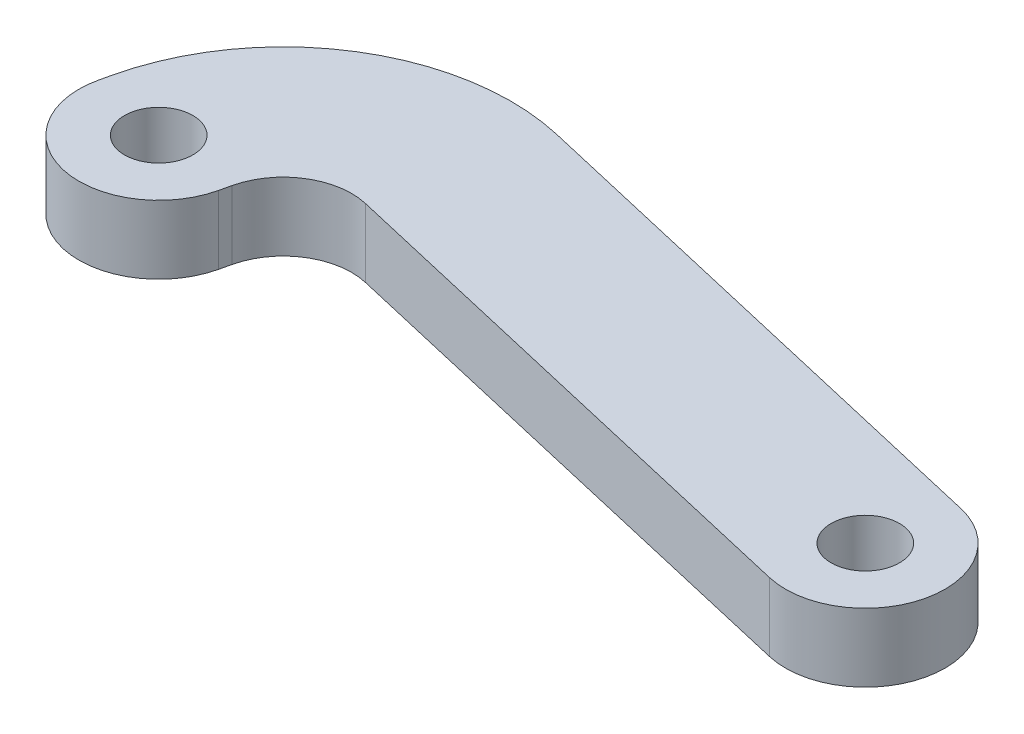
ISO-10303-21;
HEADER;
FILE_DESCRIPTION(('STEP AP214'),'2;1');
FILE_NAME('part.step','',(''),(''),'','','');
FILE_SCHEMA(('AUTOMOTIVE_DESIGN { 1 0 10303 214 1 1 1 1 }'));
ENDSEC;
DATA;
#1=APPLICATION_CONTEXT('core data for automotive mechanical design processes');
#2=APPLICATION_PROTOCOL_DEFINITION('international standard','automotive_design',2000,#1);
#3=PRODUCT_CONTEXT('',#1,'mechanical');
#4=PRODUCT('Part','Part','',(#3));
#5=PRODUCT_RELATED_PRODUCT_CATEGORY('part','',(#4));
#6=PRODUCT_DEFINITION_FORMATION('','',#4);
#7=PRODUCT_DEFINITION_CONTEXT('part definition',#1,'design');
#8=PRODUCT_DEFINITION('design','',#6,#7);
#9=PRODUCT_DEFINITION_SHAPE('','',#8);
#10=(LENGTH_UNIT() NAMED_UNIT(*) SI_UNIT(.MILLI.,.METRE.));
#11=(NAMED_UNIT(*) PLANE_ANGLE_UNIT() SI_UNIT($,.RADIAN.));
#12=(NAMED_UNIT(*) SI_UNIT($,.STERADIAN.) SOLID_ANGLE_UNIT());
#13=UNCERTAINTY_MEASURE_WITH_UNIT(LENGTH_MEASURE(1.E-05),#10,'distance_accuracy_value','');
#14=(GEOMETRIC_REPRESENTATION_CONTEXT(3) GLOBAL_UNCERTAINTY_ASSIGNED_CONTEXT((#13)) GLOBAL_UNIT_ASSIGNED_CONTEXT((#10,
#11,#12)) REPRESENTATION_CONTEXT('',''));
#15=CARTESIAN_POINT('',(0.,0.,0.));
#16=DIRECTION('',(0.,0.,1.));
#17=DIRECTION('',(1.,0.,0.));
#18=AXIS2_PLACEMENT_3D('',#15,#16,#17);
#19=CARTESIAN_POINT('',(31.,3.,0.));
#20=DIRECTION('',(0.,1.,0.));
#21=DIRECTION('',(0.,0.,1.));
#22=AXIS2_PLACEMENT_3D('',#19,#20,#21);
#23=PLANE('',#22);
#24=CARTESIAN_POINT('',(0.,3.,0.));
#25=DIRECTION('',(0.,1.,0.));
#26=DIRECTION('',(0.,0.,1.));
#27=AXIS2_PLACEMENT_3D('',#24,#25,#26);
#28=CIRCLE('',#27,1.5);
#29=CARTESIAN_POINT('',(0.,3.,1.5));
#30=VERTEX_POINT('',#29);
#31=EDGE_CURVE('E135',#30,#30,#28,.T.);
#32=ORIENTED_EDGE('',*,*,#31,.F.);
#33=EDGE_LOOP('',(#32));
#34=FACE_BOUND('',#33,.T.);
#35=CARTESIAN_POINT('',(31.,3.,0.));
#36=DIRECTION('',(0.,1.,0.));
#37=DIRECTION('',(0.,0.,1.));
#38=AXIS2_PLACEMENT_3D('',#35,#36,#37);
#39=CIRCLE('',#38,3.5);
#40=CARTESIAN_POINT('',(30.2096774193548,3.,3.40960264818679));
#41=VERTEX_POINT('',#40);
#42=CARTESIAN_POINT('',(31.7903225806452,3.,-3.40960264818679));
#43=VERTEX_POINT('',#42);
#44=EDGE_CURVE('E146',#41,#43,#39,.T.);
#45=ORIENTED_EDGE('',*,*,#44,.T.);
#46=DIRECTION('',(-0.974172185196226,0.,-0.225806451612903));
#47=VECTOR('',#46,1.);
#48=CARTESIAN_POINT('',(8.70308694571095,3.,-8.7610660090765));
#49=LINE('',#48,#47);
#50=CARTESIAN_POINT('',(8.70308694571095,3.,-8.7610660090765));
#51=VERTEX_POINT('',#50);
#52=EDGE_CURVE('E94',#43,#51,#49,.T.);
#53=ORIENTED_EDGE('',*,*,#52,.T.);
#54=CARTESIAN_POINT('',(6.44502242958192,3.,0.98065584288576));
#55=DIRECTION('',(0.,1.,0.));
#56=DIRECTION('',(0.,0.,-1.));
#57=AXIS2_PLACEMENT_3D('',#54,#55,#56);
#58=CIRCLE('',#57,10.);
#59=CARTESIAN_POINT('',(-3.29669942238034,3.,-1.27740867324327));
#60=VERTEX_POINT('',#59);
#61=EDGE_CURVE('E161',#51,#60,#58,.T.);
#62=ORIENTED_EDGE('',*,*,#61,.T.);
#63=DIRECTION('',(-0.225806451612904,0.,0.974172185196226));
#64=VECTOR('',#63,1.);
#65=CARTESIAN_POINT('',(-3.40960264818679,3.,-0.790322580645162));
#66=LINE('',#65,#64);
#67=CARTESIAN_POINT('',(-3.40960264818679,3.,-0.790322580645159));
#68=VERTEX_POINT('',#67);
#69=EDGE_CURVE('E174',#60,#68,#66,.T.);
#70=ORIENTED_EDGE('',*,*,#69,.T.);
#71=CARTESIAN_POINT('',(0.,3.,0.));
#72=DIRECTION('',(0.,1.,0.));
#73=DIRECTION('',(0.,0.,-1.));
#74=AXIS2_PLACEMENT_3D('',#71,#72,#73);
#75=CIRCLE('',#74,3.5);
#76=CARTESIAN_POINT('',(3.40960264818678,3.,0.79032258064516));
#77=VERTEX_POINT('',#76);
#78=EDGE_CURVE('E113',#68,#77,#75,.T.);
#79=ORIENTED_EDGE('',*,*,#78,.T.);
#80=DIRECTION('',(0.225806451612901,0.,-0.974172185196226));
#81=VECTOR('',#80,1.);
#82=CARTESIAN_POINT('',(3.40960264818678,3.,0.79032258064516));
#83=LINE('',#82,#81);
#84=CARTESIAN_POINT('',(3.52250587399324,3.,0.303236488047049));
#85=VERTEX_POINT('',#84);
#86=EDGE_CURVE('E107',#77,#85,#83,.T.);
#87=ORIENTED_EDGE('',*,*,#86,.T.);
#88=CARTESIAN_POINT('',(6.44502242958192,3.,0.980655842885758));
#89=DIRECTION('',(0.,-1.,0.));
#90=DIRECTION('',(0.,0.,-1.));
#91=AXIS2_PLACEMENT_3D('',#88,#89,#90);
#92=CIRCLE('',#91,3.);
#93=CARTESIAN_POINT('',(7.12244178442063,3.,-1.94186071270292));
#94=VERTEX_POINT('',#93);
#95=EDGE_CURVE('E111',#85,#94,#92,.T.);
#96=ORIENTED_EDGE('',*,*,#95,.T.);
#97=DIRECTION('',(0.974172185196226,0.,0.225806451612903));
#98=VECTOR('',#97,1.);
#99=CARTESIAN_POINT('',(7.12244178442063,3.,-1.94186071270292));
#100=LINE('',#99,#98);
#101=EDGE_CURVE('E51',#94,#41,#100,.T.);
#102=ORIENTED_EDGE('',*,*,#101,.T.);
#103=EDGE_LOOP('',(#45,#53,#62,#70,#79,#87,#96,#102));
#104=FACE_BOUND('',#103,.T.);
#105=CARTESIAN_POINT('',(31.,3.,0.));
#106=DIRECTION('',(0.,1.,0.));
#107=DIRECTION('',(0.,0.,1.));
#108=AXIS2_PLACEMENT_3D('',#105,#106,#107);
#109=CIRCLE('',#108,1.5);
#110=CARTESIAN_POINT('',(31.,3.,1.5));
#111=VERTEX_POINT('',#110);
#112=EDGE_CURVE('E183',#111,#111,#109,.T.);
#113=ORIENTED_EDGE('',*,*,#112,.F.);
#114=EDGE_LOOP('',(#113));
#115=FACE_BOUND('',#114,.T.);
#116=ADVANCED_FACE('F34',(#34,#104,#115),#23,.T.);
#117=CARTESIAN_POINT('',(31.,0.,0.));
#118=DIRECTION('',(0.,1.,0.));
#119=DIRECTION('',(0.,0.,1.));
#120=AXIS2_PLACEMENT_3D('',#117,#118,#119);
#121=PLANE('',#120);
#122=CARTESIAN_POINT('',(31.,0.,0.));
#123=DIRECTION('',(0.,1.,0.));
#124=DIRECTION('',(0.,0.,1.));
#125=AXIS2_PLACEMENT_3D('',#122,#123,#124);
#126=CIRCLE('',#125,3.5);
#127=CARTESIAN_POINT('',(30.2096774193548,0.,3.40960264818679));
#128=VERTEX_POINT('',#127);
#129=CARTESIAN_POINT('',(31.7903225806452,0.,-3.40960264818679));
#130=VERTEX_POINT('',#129);
#131=EDGE_CURVE('E131',#128,#130,#126,.T.);
#132=ORIENTED_EDGE('',*,*,#131,.F.);
#133=DIRECTION('',(0.974172185196226,0.,0.225806451612903));
#134=VECTOR('',#133,1.);
#135=CARTESIAN_POINT('',(7.12244178442063,0.,-1.94186071270292));
#136=LINE('',#135,#134);
#137=CARTESIAN_POINT('',(7.12244178442063,0.,-1.94186071270292));
#138=VERTEX_POINT('',#137);
#139=EDGE_CURVE('E86',#138,#128,#136,.T.);
#140=ORIENTED_EDGE('',*,*,#139,.F.);
#141=CARTESIAN_POINT('',(6.44502242958192,0.,0.980655842885758));
#142=DIRECTION('',(0.,-1.,0.));
#143=DIRECTION('',(0.,0.,-1.));
#144=AXIS2_PLACEMENT_3D('',#141,#142,#143);
#145=CIRCLE('',#144,3.);
#146=CARTESIAN_POINT('',(3.52250587399324,0.,0.303236488047049));
#147=VERTEX_POINT('',#146);
#148=EDGE_CURVE('E80',#147,#138,#145,.T.);
#149=ORIENTED_EDGE('',*,*,#148,.F.);
#150=DIRECTION('',(0.225806451612901,0.,-0.974172185196226));
#151=VECTOR('',#150,1.);
#152=CARTESIAN_POINT('',(3.40960264818678,0.,0.79032258064516));
#153=LINE('',#152,#151);
#154=CARTESIAN_POINT('',(3.40960264818678,0.,0.79032258064516));
#155=VERTEX_POINT('',#154);
#156=EDGE_CURVE('E121',#155,#147,#153,.T.);
#157=ORIENTED_EDGE('',*,*,#156,.F.);
#158=CARTESIAN_POINT('',(0.,0.,0.));
#159=DIRECTION('',(0.,1.,0.));
#160=DIRECTION('',(0.,0.,-1.));
#161=AXIS2_PLACEMENT_3D('',#158,#159,#160);
#162=CIRCLE('',#161,3.5);
#163=CARTESIAN_POINT('',(-3.40960264818679,0.,-0.790322580645159));
#164=VERTEX_POINT('',#163);
#165=EDGE_CURVE('E141',#164,#155,#162,.T.);
#166=ORIENTED_EDGE('',*,*,#165,.F.);
#167=DIRECTION('',(-0.225806451612904,0.,0.974172185196226));
#168=VECTOR('',#167,1.);
#169=CARTESIAN_POINT('',(-3.40960264818679,0.,-0.790322580645162));
#170=LINE('',#169,#168);
#171=CARTESIAN_POINT('',(-3.29669942238034,0.,-1.27740867324327));
#172=VERTEX_POINT('',#171);
#173=EDGE_CURVE('E139',#172,#164,#170,.T.);
#174=ORIENTED_EDGE('',*,*,#173,.F.);
#175=CARTESIAN_POINT('',(6.44502242958192,0.,0.98065584288576));
#176=DIRECTION('',(0.,1.,0.));
#177=DIRECTION('',(0.,0.,-1.));
#178=AXIS2_PLACEMENT_3D('',#175,#176,#177);
#179=CIRCLE('',#178,10.);
#180=CARTESIAN_POINT('',(8.70308694571095,0.,-8.7610660090765));
#181=VERTEX_POINT('',#180);
#182=EDGE_CURVE('E137',#181,#172,#179,.T.);
#183=ORIENTED_EDGE('',*,*,#182,.F.);
#184=DIRECTION('',(-0.974172185196226,0.,-0.225806451612903));
#185=VECTOR('',#184,1.);
#186=CARTESIAN_POINT('',(8.70308694571095,0.,-8.7610660090765));
#187=LINE('',#186,#185);
#188=EDGE_CURVE('E134',#130,#181,#187,.T.);
#189=ORIENTED_EDGE('',*,*,#188,.F.);
#190=EDGE_LOOP('',(#132,#140,#149,#157,#166,#174,#183,#189));
#191=FACE_BOUND('',#190,.T.);
#192=CARTESIAN_POINT('',(0.,0.,0.));
#193=DIRECTION('',(0.,1.,0.));
#194=DIRECTION('',(0.,0.,1.));
#195=AXIS2_PLACEMENT_3D('',#192,#193,#194);
#196=CIRCLE('',#195,1.5);
#197=CARTESIAN_POINT('',(0.,0.,1.5));
#198=VERTEX_POINT('',#197);
#199=EDGE_CURVE('E180',#198,#198,#196,.T.);
#200=ORIENTED_EDGE('',*,*,#199,.T.);
#201=EDGE_LOOP('',(#200));
#202=FACE_BOUND('',#201,.T.);
#203=CARTESIAN_POINT('',(31.,0.,0.));
#204=DIRECTION('',(0.,1.,0.));
#205=DIRECTION('',(0.,0.,1.));
#206=AXIS2_PLACEMENT_3D('',#203,#204,#205);
#207=CIRCLE('',#206,1.5);
#208=CARTESIAN_POINT('',(31.,0.,1.5));
#209=VERTEX_POINT('',#208);
#210=EDGE_CURVE('E186',#209,#209,#207,.T.);
#211=ORIENTED_EDGE('',*,*,#210,.T.);
#212=EDGE_LOOP('',(#211));
#213=FACE_BOUND('',#212,.T.);
#214=ADVANCED_FACE('F165',(#191,#202,#213),#121,.F.);
#215=CARTESIAN_POINT('',(31.,3.,0.));
#216=DIRECTION('',(0.,-1.,0.));
#217=DIRECTION('',(0.,0.,-1.));
#218=AXIS2_PLACEMENT_3D('',#215,#216,#217);
#219=CYLINDRICAL_SURFACE('',#218,3.5);
#220=ORIENTED_EDGE('',*,*,#131,.T.);
#221=DIRECTION('',(0.,-1.,0.));
#222=VECTOR('',#221,1.);
#223=CARTESIAN_POINT('',(31.7903225806452,3.,-3.40960264818679));
#224=LINE('',#223,#222);
#225=EDGE_CURVE('E11',#43,#130,#224,.T.);
#226=ORIENTED_EDGE('',*,*,#225,.F.);
#227=ORIENTED_EDGE('',*,*,#44,.F.);
#228=DIRECTION('',(0.,-1.,0.));
#229=VECTOR('',#228,1.);
#230=CARTESIAN_POINT('',(30.2096774193548,3.,3.40960264818679));
#231=LINE('',#230,#229);
#232=EDGE_CURVE('E127',#41,#128,#231,.T.);
#233=ORIENTED_EDGE('',*,*,#232,.T.);
#234=EDGE_LOOP('',(#220,#226,#227,#233));
#235=FACE_BOUND('',#234,.T.);
#236=ADVANCED_FACE('F36',(#235),#219,.T.);
#237=CARTESIAN_POINT('',(8.70308694571095,3.,-8.7610660090765));
#238=DIRECTION('',(-0.225806451612903,0.,0.974172185196226));
#239=DIRECTION('',(0.974172185196226,0.,0.225806451612903));
#240=AXIS2_PLACEMENT_3D('',#237,#238,#239);
#241=PLANE('',#240);
#242=ORIENTED_EDGE('',*,*,#188,.T.);
#243=DIRECTION('',(0.,-1.,0.));
#244=VECTOR('',#243,1.);
#245=CARTESIAN_POINT('',(8.70308694571095,3.,-8.7610660090765));
#246=LINE('',#245,#244);
#247=EDGE_CURVE('E43',#51,#181,#246,.T.);
#248=ORIENTED_EDGE('',*,*,#247,.F.);
#249=ORIENTED_EDGE('',*,*,#52,.F.);
#250=ORIENTED_EDGE('',*,*,#225,.T.);
#251=EDGE_LOOP('',(#242,#248,#249,#250));
#252=FACE_BOUND('',#251,.T.);
#253=ADVANCED_FACE('F218',(#252),#241,.F.);
#254=CARTESIAN_POINT('',(6.44502242958192,3.,0.98065584288576));
#255=DIRECTION('',(0.,-1.,0.));
#256=DIRECTION('',(0.,0.,-1.));
#257=AXIS2_PLACEMENT_3D('',#254,#255,#256);
#258=CYLINDRICAL_SURFACE('',#257,10.);
#259=ORIENTED_EDGE('',*,*,#182,.T.);
#260=DIRECTION('',(0.,-1.,0.));
#261=VECTOR('',#260,1.);
#262=CARTESIAN_POINT('',(-3.29669942238034,3.,-1.27740867324327));
#263=LINE('',#262,#261);
#264=EDGE_CURVE('E153',#60,#172,#263,.T.);
#265=ORIENTED_EDGE('',*,*,#264,.F.);
#266=ORIENTED_EDGE('',*,*,#61,.F.);
#267=ORIENTED_EDGE('',*,*,#247,.T.);
#268=EDGE_LOOP('',(#259,#265,#266,#267));
#269=FACE_BOUND('',#268,.T.);
#270=ADVANCED_FACE('F159',(#269),#258,.T.);
#271=CARTESIAN_POINT('',(-3.40960264818679,3.,-0.790322580645162));
#272=DIRECTION('',(0.974172185196226,0.,0.225806451612904));
#273=DIRECTION('',(0.225806451612904,0.,-0.974172185196226));
#274=AXIS2_PLACEMENT_3D('',#271,#272,#273);
#275=PLANE('',#274);
#276=ORIENTED_EDGE('',*,*,#173,.T.);
#277=DIRECTION('',(0.,-1.,0.));
#278=VECTOR('',#277,1.);
#279=CARTESIAN_POINT('',(-3.40960264818679,3.,-0.790322580645159));
#280=LINE('',#279,#278);
#281=EDGE_CURVE('E150',#68,#164,#280,.T.);
#282=ORIENTED_EDGE('',*,*,#281,.F.);
#283=ORIENTED_EDGE('',*,*,#69,.F.);
#284=ORIENTED_EDGE('',*,*,#264,.T.);
#285=EDGE_LOOP('',(#276,#282,#283,#284));
#286=FACE_BOUND('',#285,.T.);
#287=ADVANCED_FACE('F170',(#286),#275,.F.);
#288=CARTESIAN_POINT('',(0.,3.,0.));
#289=DIRECTION('',(0.,-1.,0.));
#290=DIRECTION('',(0.,0.,-1.));
#291=AXIS2_PLACEMENT_3D('',#288,#289,#290);
#292=CYLINDRICAL_SURFACE('',#291,3.5);
#293=ORIENTED_EDGE('',*,*,#165,.T.);
#294=DIRECTION('',(0.,-1.,0.));
#295=VECTOR('',#294,1.);
#296=CARTESIAN_POINT('',(3.40960264818678,3.,0.79032258064516));
#297=LINE('',#296,#295);
#298=EDGE_CURVE('E122',#77,#155,#297,.T.);
#299=ORIENTED_EDGE('',*,*,#298,.F.);
#300=ORIENTED_EDGE('',*,*,#78,.F.);
#301=ORIENTED_EDGE('',*,*,#281,.T.);
#302=EDGE_LOOP('',(#293,#299,#300,#301));
#303=FACE_BOUND('',#302,.T.);
#304=ADVANCED_FACE('F173',(#303),#292,.T.);
#305=CARTESIAN_POINT('',(3.40960264818678,3.,0.79032258064516));
#306=DIRECTION('',(-0.974172185196226,0.,-0.225806451612901));
#307=DIRECTION('',(-0.225806451612901,0.,0.974172185196226));
#308=AXIS2_PLACEMENT_3D('',#305,#306,#307);
#309=PLANE('',#308);
#310=ORIENTED_EDGE('',*,*,#156,.T.);
#311=DIRECTION('',(0.,-1.,0.));
#312=VECTOR('',#311,1.);
#313=CARTESIAN_POINT('',(3.52250587399324,3.,0.303236488047049));
#314=LINE('',#313,#312);
#315=EDGE_CURVE('E118',#85,#147,#314,.T.);
#316=ORIENTED_EDGE('',*,*,#315,.F.);
#317=ORIENTED_EDGE('',*,*,#86,.F.);
#318=ORIENTED_EDGE('',*,*,#298,.T.);
#319=EDGE_LOOP('',(#310,#316,#317,#318));
#320=FACE_BOUND('',#319,.T.);
#321=ADVANCED_FACE('F119',(#320),#309,.F.);
#322=CARTESIAN_POINT('',(6.44502242958192,3.,0.980655842885758));
#323=DIRECTION('',(0.,-1.,0.));
#324=DIRECTION('',(0.,0.,-1.));
#325=AXIS2_PLACEMENT_3D('',#322,#323,#324);
#326=CYLINDRICAL_SURFACE('',#325,3.);
#327=ORIENTED_EDGE('',*,*,#148,.T.);
#328=DIRECTION('',(0.,-1.,0.));
#329=VECTOR('',#328,1.);
#330=CARTESIAN_POINT('',(7.12244178442063,3.,-1.94186071270292));
#331=LINE('',#330,#329);
#332=EDGE_CURVE('E123',#94,#138,#331,.T.);
#333=ORIENTED_EDGE('',*,*,#332,.F.);
#334=ORIENTED_EDGE('',*,*,#95,.F.);
#335=ORIENTED_EDGE('',*,*,#315,.T.);
#336=EDGE_LOOP('',(#327,#333,#334,#335));
#337=FACE_BOUND('',#336,.T.);
#338=ADVANCED_FACE('F125',(#337),#326,.F.);
#339=CARTESIAN_POINT('',(7.12244178442063,3.,-1.94186071270292));
#340=DIRECTION('',(0.225806451612903,0.,-0.974172185196226));
#341=DIRECTION('',(-0.974172185196226,0.,-0.225806451612903));
#342=AXIS2_PLACEMENT_3D('',#339,#340,#341);
#343=PLANE('',#342);
#344=ORIENTED_EDGE('',*,*,#139,.T.);
#345=ORIENTED_EDGE('',*,*,#232,.F.);
#346=ORIENTED_EDGE('',*,*,#101,.F.);
#347=ORIENTED_EDGE('',*,*,#332,.T.);
#348=EDGE_LOOP('',(#344,#345,#346,#347));
#349=FACE_BOUND('',#348,.T.);
#350=ADVANCED_FACE('F206',(#349),#343,.F.);
#351=CARTESIAN_POINT('',(0.,3.,0.));
#352=DIRECTION('',(0.,-1.,0.));
#353=DIRECTION('',(0.,0.,-1.));
#354=AXIS2_PLACEMENT_3D('',#351,#352,#353);
#355=CYLINDRICAL_SURFACE('',#354,1.5);
#356=ORIENTED_EDGE('',*,*,#31,.T.);
#357=EDGE_LOOP('',(#356));
#358=FACE_BOUND('',#357,.T.);
#359=ORIENTED_EDGE('',*,*,#199,.F.);
#360=EDGE_LOOP('',(#359));
#361=FACE_BOUND('',#360,.T.);
#362=ADVANCED_FACE('F203',(#358,#361),#355,.F.);
#363=CARTESIAN_POINT('',(31.,3.,0.));
#364=DIRECTION('',(0.,-1.,0.));
#365=DIRECTION('',(0.,0.,-1.));
#366=AXIS2_PLACEMENT_3D('',#363,#364,#365);
#367=CYLINDRICAL_SURFACE('',#366,1.5);
#368=ORIENTED_EDGE('',*,*,#112,.T.);
#369=EDGE_LOOP('',(#368));
#370=FACE_BOUND('',#369,.T.);
#371=ORIENTED_EDGE('',*,*,#210,.F.);
#372=EDGE_LOOP('',(#371));
#373=FACE_BOUND('',#372,.T.);
#374=ADVANCED_FACE('F192',(#370,#373),#367,.F.);
#375=CLOSED_SHELL('',(#116,#214,#236,#253,#270,#287,#304,#321,#338,#350,#362,#374));
#376=MANIFOLD_SOLID_BREP('B2',#375);
#377=ADVANCED_BREP_SHAPE_REPRESENTATION('',(#18,#376),#14);
#378=SHAPE_DEFINITION_REPRESENTATION(#9,#377);
ENDSEC;
END-ISO-10303-21;
